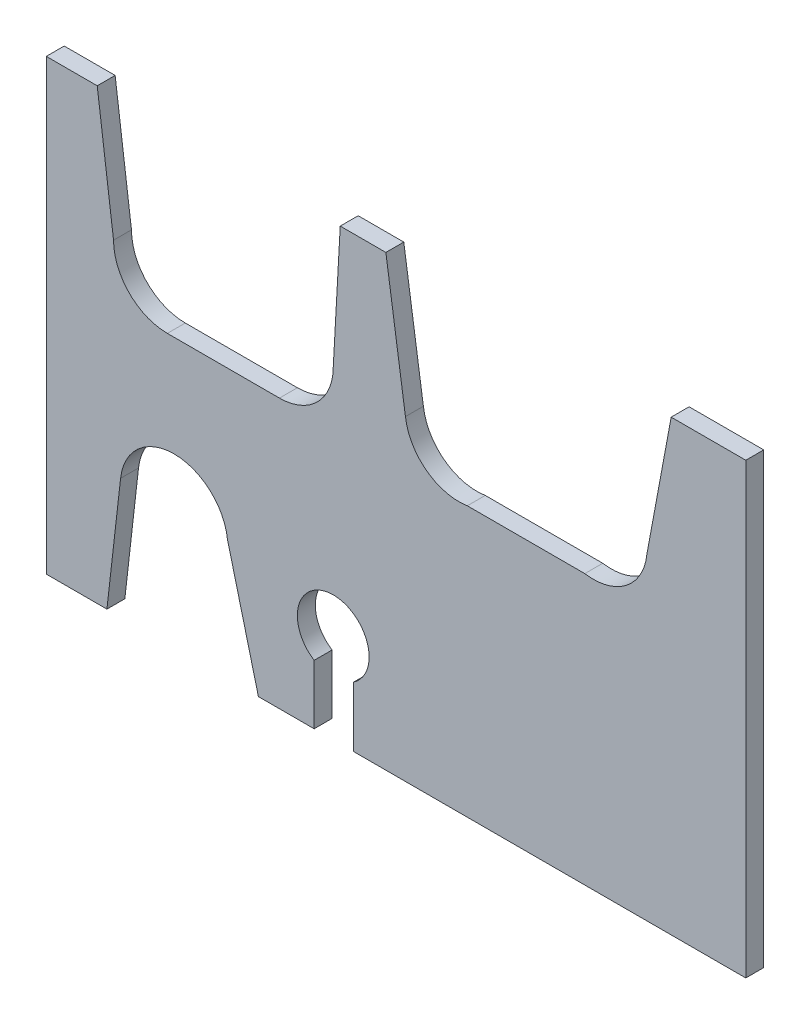
ISO-10303-21;
HEADER;
FILE_DESCRIPTION(('STEP AP214'),'2;1');
FILE_NAME('part.step','',(''),(''),'','','');
FILE_SCHEMA(('AUTOMOTIVE_DESIGN { 1 0 10303 214 1 1 1 1 }'));
ENDSEC;
DATA;
#1=APPLICATION_CONTEXT('core data for automotive mechanical design processes');
#2=APPLICATION_PROTOCOL_DEFINITION('international standard','automotive_design',2000,#1);
#3=PRODUCT_CONTEXT('',#1,'mechanical');
#4=PRODUCT('Part','Part','',(#3));
#5=PRODUCT_RELATED_PRODUCT_CATEGORY('part','',(#4));
#6=PRODUCT_DEFINITION_FORMATION('','',#4);
#7=PRODUCT_DEFINITION_CONTEXT('part definition',#1,'design');
#8=PRODUCT_DEFINITION('design','',#6,#7);
#9=PRODUCT_DEFINITION_SHAPE('','',#8);
#10=(LENGTH_UNIT() NAMED_UNIT(*) SI_UNIT(.MILLI.,.METRE.));
#11=(NAMED_UNIT(*) PLANE_ANGLE_UNIT() SI_UNIT($,.RADIAN.));
#12=(NAMED_UNIT(*) SI_UNIT($,.STERADIAN.) SOLID_ANGLE_UNIT());
#13=UNCERTAINTY_MEASURE_WITH_UNIT(LENGTH_MEASURE(1.E-05),#10,'distance_accuracy_value','');
#14=(GEOMETRIC_REPRESENTATION_CONTEXT(3) GLOBAL_UNCERTAINTY_ASSIGNED_CONTEXT((#13)) GLOBAL_UNIT_ASSIGNED_CONTEXT((#10,
#11,#12)) REPRESENTATION_CONTEXT('',''));
#15=CARTESIAN_POINT('',(0.,0.,0.));
#16=DIRECTION('',(0.,0.,1.));
#17=DIRECTION('',(1.,0.,0.));
#18=AXIS2_PLACEMENT_3D('',#15,#16,#17);
#19=CARTESIAN_POINT('',(-46.,32.,2.));
#20=DIRECTION('',(0.,-1.,0.));
#21=DIRECTION('',(0.,0.,-1.));
#22=AXIS2_PLACEMENT_3D('',#19,#20,#21);
#23=PLANE('',#22);
#24=DIRECTION('',(-1.,0.,0.));
#25=VECTOR('',#24,1.);
#26=CARTESIAN_POINT('',(-46.,32.,0.));
#27=LINE('',#26,#25);
#28=CARTESIAN_POINT('',(32.,32.,0.));
#29=VERTEX_POINT('',#28);
#30=CARTESIAN_POINT('',(23.6800072298775,32.,0.));
#31=VERTEX_POINT('',#30);
#32=EDGE_CURVE('E253',#29,#31,#27,.T.);
#33=ORIENTED_EDGE('',*,*,#32,.T.);
#34=DIRECTION('',(0.,0.,1.));
#35=VECTOR('',#34,1.);
#36=CARTESIAN_POINT('',(23.6800072298775,32.,0.));
#37=LINE('',#36,#35);
#38=CARTESIAN_POINT('',(23.6800072298775,32.,2.));
#39=VERTEX_POINT('',#38);
#40=EDGE_CURVE('E221',#31,#39,#37,.T.);
#41=ORIENTED_EDGE('',*,*,#40,.T.);
#42=DIRECTION('',(-1.,0.,0.));
#43=VECTOR('',#42,1.);
#44=CARTESIAN_POINT('',(-46.,32.,2.));
#45=LINE('',#44,#43);
#46=CARTESIAN_POINT('',(32.,32.,2.));
#47=VERTEX_POINT('',#46);
#48=EDGE_CURVE('E238',#47,#39,#45,.T.);
#49=ORIENTED_EDGE('',*,*,#48,.F.);
#50=DIRECTION('',(0.,0.,-1.));
#51=VECTOR('',#50,1.);
#52=CARTESIAN_POINT('',(32.,32.,2.));
#53=LINE('',#52,#51);
#54=EDGE_CURVE('E271',#47,#29,#53,.T.);
#55=ORIENTED_EDGE('',*,*,#54,.T.);
#56=EDGE_LOOP('',(#33,#41,#49,#55));
#57=FACE_BOUND('',#56,.T.);
#58=ADVANCED_FACE('F39',(#57),#23,.F.);
#59=CARTESIAN_POINT('',(-40.3195514634934,32.,2.));
#60=VERTEX_POINT('',#59);
#61=CARTESIAN_POINT('',(-46.,32.,2.));
#62=VERTEX_POINT('',#61);
#63=EDGE_CURVE('E236',#60,#62,#45,.T.);
#64=ORIENTED_EDGE('',*,*,#63,.F.);
#65=DIRECTION('',(0.,0.,1.));
#66=VECTOR('',#65,1.);
#67=CARTESIAN_POINT('',(-40.3195514634934,32.,0.));
#68=LINE('',#67,#66);
#69=CARTESIAN_POINT('',(-40.3195514634934,32.,0.));
#70=VERTEX_POINT('',#69);
#71=EDGE_CURVE('E380',#70,#60,#68,.T.);
#72=ORIENTED_EDGE('',*,*,#71,.F.);
#73=CARTESIAN_POINT('',(-46.,32.,0.));
#74=VERTEX_POINT('',#73);
#75=EDGE_CURVE('E252',#70,#74,#27,.T.);
#76=ORIENTED_EDGE('',*,*,#75,.T.);
#77=DIRECTION('',(0.,0.,-1.));
#78=VECTOR('',#77,1.);
#79=CARTESIAN_POINT('',(-46.,32.,2.));
#80=LINE('',#79,#78);
#81=EDGE_CURVE('E268',#62,#74,#80,.T.);
#82=ORIENTED_EDGE('',*,*,#81,.F.);
#83=EDGE_LOOP('',(#64,#72,#76,#82));
#84=FACE_BOUND('',#83,.T.);
#85=ADVANCED_FACE('F400',(#84),#23,.F.);
#86=CARTESIAN_POINT('',(-45.9999999999999,-18.,2.));
#87=DIRECTION('',(0.,1.,0.));
#88=DIRECTION('',(0.,0.,1.));
#89=AXIS2_PLACEMENT_3D('',#86,#87,#88);
#90=PLANE('',#89);
#91=DIRECTION('',(1.,0.,0.));
#92=VECTOR('',#91,1.);
#93=CARTESIAN_POINT('',(-45.9999999999999,-18.,2.));
#94=LINE('',#93,#92);
#95=CARTESIAN_POINT('',(-11.7335318842224,-18.,2.));
#96=VERTEX_POINT('',#95);
#97=CARTESIAN_POINT('',(32.,-18.,2.));
#98=VERTEX_POINT('',#97);
#99=EDGE_CURVE('E244',#96,#98,#94,.T.);
#100=ORIENTED_EDGE('',*,*,#99,.F.);
#101=DIRECTION('',(0.,0.,1.));
#102=VECTOR('',#101,1.);
#103=CARTESIAN_POINT('',(-11.7335318842224,-18.,0.));
#104=LINE('',#103,#102);
#105=CARTESIAN_POINT('',(-11.7335318842224,-18.,0.));
#106=VERTEX_POINT('',#105);
#107=EDGE_CURVE('E363',#106,#96,#104,.T.);
#108=ORIENTED_EDGE('',*,*,#107,.F.);
#109=DIRECTION('',(1.,0.,0.));
#110=VECTOR('',#109,1.);
#111=CARTESIAN_POINT('',(-45.9999999999999,-18.,0.));
#112=LINE('',#111,#110);
#113=CARTESIAN_POINT('',(32.,-18.,0.));
#114=VERTEX_POINT('',#113);
#115=EDGE_CURVE('E259',#106,#114,#112,.T.);
#116=ORIENTED_EDGE('',*,*,#115,.T.);
#117=DIRECTION('',(0.,0.,-1.));
#118=VECTOR('',#117,1.);
#119=CARTESIAN_POINT('',(32.,-18.,2.));
#120=LINE('',#119,#118);
#121=EDGE_CURVE('E248',#98,#114,#120,.T.);
#122=ORIENTED_EDGE('',*,*,#121,.F.);
#123=EDGE_LOOP('',(#100,#108,#116,#122));
#124=FACE_BOUND('',#123,.T.);
#125=ADVANCED_FACE('F430',(#124),#90,.F.);
#126=CARTESIAN_POINT('',(-22.3456340523427,-18.,0.));
#127=VERTEX_POINT('',#126);
#128=CARTESIAN_POINT('',(-16.1286236707562,-18.,0.));
#129=VERTEX_POINT('',#128);
#130=EDGE_CURVE('E262',#127,#129,#112,.T.);
#131=ORIENTED_EDGE('',*,*,#130,.T.);
#132=DIRECTION('',(0.,0.,1.));
#133=VECTOR('',#132,1.);
#134=CARTESIAN_POINT('',(-16.1286236707562,-18.,0.));
#135=LINE('',#134,#133);
#136=CARTESIAN_POINT('',(-16.1286236707562,-18.,2.));
#137=VERTEX_POINT('',#136);
#138=EDGE_CURVE('E365',#129,#137,#135,.T.);
#139=ORIENTED_EDGE('',*,*,#138,.T.);
#140=CARTESIAN_POINT('',(-22.3456340523427,-18.,2.));
#141=VERTEX_POINT('',#140);
#142=EDGE_CURVE('E249',#141,#137,#94,.T.);
#143=ORIENTED_EDGE('',*,*,#142,.F.);
#144=DIRECTION('',(0.,0.,1.));
#145=VECTOR('',#144,1.);
#146=CARTESIAN_POINT('',(-22.3456340523427,-18.,0.));
#147=LINE('',#146,#145);
#148=EDGE_CURVE('E321',#127,#141,#147,.T.);
#149=ORIENTED_EDGE('',*,*,#148,.F.);
#150=EDGE_LOOP('',(#131,#139,#143,#149));
#151=FACE_BOUND('',#150,.T.);
#152=ADVANCED_FACE('F440',(#151),#90,.F.);
#153=CARTESIAN_POINT('',(32.,32.,2.));
#154=DIRECTION('',(-1.,0.,0.));
#155=DIRECTION('',(0.,0.,1.));
#156=AXIS2_PLACEMENT_3D('',#153,#154,#155);
#157=PLANE('',#156);
#158=DIRECTION('',(0.,1.,0.));
#159=VECTOR('',#158,1.);
#160=CARTESIAN_POINT('',(32.,32.,0.));
#161=LINE('',#160,#159);
#162=EDGE_CURVE('E227',#114,#29,#161,.T.);
#163=ORIENTED_EDGE('',*,*,#162,.T.);
#164=ORIENTED_EDGE('',*,*,#54,.F.);
#165=DIRECTION('',(0.,1.,0.));
#166=VECTOR('',#165,1.);
#167=CARTESIAN_POINT('',(32.,32.,2.));
#168=LINE('',#167,#166);
#169=EDGE_CURVE('E233',#98,#47,#168,.T.);
#170=ORIENTED_EDGE('',*,*,#169,.F.);
#171=ORIENTED_EDGE('',*,*,#121,.T.);
#172=EDGE_LOOP('',(#163,#164,#170,#171));
#173=FACE_BOUND('',#172,.T.);
#174=ADVANCED_FACE('F41',(#173),#157,.F.);
#175=CARTESIAN_POINT('',(-8.13437362696619,32.,2.));
#176=VERTEX_POINT('',#175);
#177=CARTESIAN_POINT('',(-13.2215055956665,32.,2.));
#178=VERTEX_POINT('',#177);
#179=EDGE_CURVE('E242',#176,#178,#45,.T.);
#180=ORIENTED_EDGE('',*,*,#179,.F.);
#181=DIRECTION('',(0.,0.,1.));
#182=VECTOR('',#181,1.);
#183=CARTESIAN_POINT('',(-8.13437362696619,32.,0.));
#184=LINE('',#183,#182);
#185=CARTESIAN_POINT('',(-8.13437362696619,32.,0.));
#186=VERTEX_POINT('',#185);
#187=EDGE_CURVE('E343',#186,#176,#184,.T.);
#188=ORIENTED_EDGE('',*,*,#187,.F.);
#189=CARTESIAN_POINT('',(-13.2215055956665,32.,0.));
#190=VERTEX_POINT('',#189);
#191=EDGE_CURVE('E257',#186,#190,#27,.T.);
#192=ORIENTED_EDGE('',*,*,#191,.T.);
#193=DIRECTION('',(0.,0.,1.));
#194=VECTOR('',#193,1.);
#195=CARTESIAN_POINT('',(-13.2215055956665,32.,0.));
#196=LINE('',#195,#194);
#197=EDGE_CURVE('E382',#190,#178,#196,.T.);
#198=ORIENTED_EDGE('',*,*,#197,.T.);
#199=EDGE_LOOP('',(#180,#188,#192,#198));
#200=FACE_BOUND('',#199,.T.);
#201=ADVANCED_FACE('F405',(#200),#23,.F.);
#202=CARTESIAN_POINT('',(-46.,32.,2.));
#203=DIRECTION('',(1.,0.,0.));
#204=DIRECTION('',(0.,1.,0.));
#205=AXIS2_PLACEMENT_3D('',#202,#203,#204);
#206=PLANE('',#205);
#207=DIRECTION('',(0.,-1.,0.));
#208=VECTOR('',#207,1.);
#209=CARTESIAN_POINT('',(-46.,32.,0.));
#210=LINE('',#209,#208);
#211=CARTESIAN_POINT('',(-45.9999999999999,-18.,0.));
#212=VERTEX_POINT('',#211);
#213=EDGE_CURVE('E256',#74,#212,#210,.T.);
#214=ORIENTED_EDGE('',*,*,#213,.T.);
#215=DIRECTION('',(0.,0.,-1.));
#216=VECTOR('',#215,1.);
#217=CARTESIAN_POINT('',(-45.9999999999999,-18.,2.));
#218=LINE('',#217,#216);
#219=CARTESIAN_POINT('',(-45.9999999999999,-18.,2.));
#220=VERTEX_POINT('',#219);
#221=EDGE_CURVE('E265',#220,#212,#218,.T.);
#222=ORIENTED_EDGE('',*,*,#221,.F.);
#223=DIRECTION('',(0.,-1.,0.));
#224=VECTOR('',#223,1.);
#225=CARTESIAN_POINT('',(-46.,32.,2.));
#226=LINE('',#225,#224);
#227=EDGE_CURVE('E241',#62,#220,#226,.T.);
#228=ORIENTED_EDGE('',*,*,#227,.F.);
#229=ORIENTED_EDGE('',*,*,#81,.T.);
#230=EDGE_LOOP('',(#214,#222,#228,#229));
#231=FACE_BOUND('',#230,.T.);
#232=ADVANCED_FACE('F433',(#231),#206,.F.);
#233=CARTESIAN_POINT('',(-39.2382725395829,-18.,0.));
#234=VERTEX_POINT('',#233);
#235=EDGE_CURVE('E237',#212,#234,#112,.T.);
#236=ORIENTED_EDGE('',*,*,#235,.T.);
#237=DIRECTION('',(0.,0.,1.));
#238=VECTOR('',#237,1.);
#239=CARTESIAN_POINT('',(-39.2382725395829,-18.,0.));
#240=LINE('',#239,#238);
#241=CARTESIAN_POINT('',(-39.2382725395829,-18.,2.));
#242=VERTEX_POINT('',#241);
#243=EDGE_CURVE('E318',#234,#242,#240,.T.);
#244=ORIENTED_EDGE('',*,*,#243,.T.);
#245=EDGE_CURVE('E245',#220,#242,#94,.T.);
#246=ORIENTED_EDGE('',*,*,#245,.F.);
#247=ORIENTED_EDGE('',*,*,#221,.T.);
#248=EDGE_LOOP('',(#236,#244,#246,#247));
#249=FACE_BOUND('',#248,.T.);
#250=ADVANCED_FACE('F438',(#249),#90,.F.);
#251=CARTESIAN_POINT('',(0.,0.,2.));
#252=DIRECTION('',(0.,0.,1.));
#253=DIRECTION('',(1.,0.,0.));
#254=AXIS2_PLACEMENT_3D('',#251,#252,#253);
#255=PLANE('',#254);
#256=DIRECTION('',(0.,1.,0.));
#257=VECTOR('',#256,1.);
#258=CARTESIAN_POINT('',(-11.7335318842224,-18.,2.));
#259=LINE('',#258,#257);
#260=CARTESIAN_POINT('',(-11.7335318842224,-11.2959251023292,2.));
#261=VERTEX_POINT('',#260);
#262=EDGE_CURVE('E354',#96,#261,#259,.T.);
#263=ORIENTED_EDGE('',*,*,#262,.F.);
#264=ORIENTED_EDGE('',*,*,#99,.T.);
#265=ORIENTED_EDGE('',*,*,#169,.T.);
#266=ORIENTED_EDGE('',*,*,#48,.T.);
#267=DIRECTION('',(0.182555710752652,0.983195510807283,0.));
#268=VECTOR('',#267,1.);
#269=CARTESIAN_POINT('',(20.7849655271757,16.408091130313,2.));
#270=LINE('',#269,#268);
#271=CARTESIAN_POINT('',(20.9708361432332,17.4091398213961,2.));
#272=VERTEX_POINT('',#271);
#273=EDGE_CURVE('E336',#272,#39,#270,.T.);
#274=ORIENTED_EDGE('',*,*,#273,.F.);
#275=CARTESIAN_POINT('',(15.,18.,2.));
#276=DIRECTION('',(0.,0.,1.));
#277=DIRECTION('',(1.,0.,0.));
#278=AXIS2_PLACEMENT_3D('',#275,#276,#277);
#279=CIRCLE('',#278,6.);
#280=CARTESIAN_POINT('',(14.0509275961501,12.0755370224593,2.));
#281=VERTEX_POINT('',#280);
#282=EDGE_CURVE('E300',#281,#272,#279,.T.);
#283=ORIENTED_EDGE('',*,*,#282,.F.);
#284=DIRECTION('',(1.,0.,0.));
#285=VECTOR('',#284,1.);
#286=CARTESIAN_POINT('',(-0.9490724038499,12.0755370224593,2.));
#287=LINE('',#286,#285);
#288=CARTESIAN_POINT('',(0.949072403849912,12.0755370224593,2.));
#289=VERTEX_POINT('',#288);
#290=EDGE_CURVE('E296',#289,#281,#287,.T.);
#291=ORIENTED_EDGE('',*,*,#290,.F.);
#292=CARTESIAN_POINT('',(0.,18.,2.));
#293=DIRECTION('',(0.,0.,1.));
#294=DIRECTION('',(1.,0.,0.));
#295=AXIS2_PLACEMENT_3D('',#292,#293,#294);
#296=CIRCLE('',#295,6.);
#297=CARTESIAN_POINT('',(-5.95130549397016,17.2371350595023,2.));
#298=VERTEX_POINT('',#297);
#299=EDGE_CURVE('E285',#298,#289,#296,.T.);
#300=ORIENTED_EDGE('',*,*,#299,.F.);
#301=DIRECTION('',(0.14628487087861,-0.989242506442191,0.));
#302=VECTOR('',#301,1.);
#303=CARTESIAN_POINT('',(-8.13437362696619,32.,2.));
#304=LINE('',#303,#302);
#305=EDGE_CURVE('E293',#176,#298,#304,.T.);
#306=ORIENTED_EDGE('',*,*,#305,.F.);
#307=ORIENTED_EDGE('',*,*,#179,.T.);
#308=DIRECTION('',(0.0555209709482199,0.998457521272171,0.));
#309=VECTOR('',#308,1.);
#310=CARTESIAN_POINT('',(-14.,18.,2.));
#311=LINE('',#310,#309);
#312=CARTESIAN_POINT('',(-14.,18.,2.));
#313=VERTEX_POINT('',#312);
#314=EDGE_CURVE('E222',#313,#178,#311,.T.);
#315=ORIENTED_EDGE('',*,*,#314,.F.);
#316=CARTESIAN_POINT('',(-20.,18.,2.));
#317=DIRECTION('',(0.,0.,1.));
#318=DIRECTION('',(1.,0.,0.));
#319=AXIS2_PLACEMENT_3D('',#316,#317,#318);
#320=CIRCLE('',#319,6.);
#321=CARTESIAN_POINT('',(-20.,12.,2.));
#322=VERTEX_POINT('',#321);
#323=EDGE_CURVE('E220',#322,#313,#320,.T.);
#324=ORIENTED_EDGE('',*,*,#323,.F.);
#325=DIRECTION('',(1.,0.,0.));
#326=VECTOR('',#325,1.);
#327=CARTESIAN_POINT('',(-32.5,12.,2.));
#328=LINE('',#327,#326);
#329=CARTESIAN_POINT('',(-32.5,12.,2.));
#330=VERTEX_POINT('',#329);
#331=EDGE_CURVE('E202',#330,#322,#328,.T.);
#332=ORIENTED_EDGE('',*,*,#331,.F.);
#333=CARTESIAN_POINT('',(-32.5,18.,2.));
#334=DIRECTION('',(0.,0.,1.));
#335=DIRECTION('',(1.,0.,0.));
#336=AXIS2_PLACEMENT_3D('',#333,#334,#335);
#337=CIRCLE('',#336,6.);
#338=CARTESIAN_POINT('',(-38.5,18.,2.));
#339=VERTEX_POINT('',#338);
#340=EDGE_CURVE('E217',#339,#330,#337,.T.);
#341=ORIENTED_EDGE('',*,*,#340,.F.);
#342=DIRECTION('',(0.128883987087097,-0.991659678454525,0.));
#343=VECTOR('',#342,1.);
#344=CARTESIAN_POINT('',(-40.3195514634934,32.,2.));
#345=LINE('',#344,#343);
#346=EDGE_CURVE('E54',#60,#339,#345,.T.);
#347=ORIENTED_EDGE('',*,*,#346,.F.);
#348=ORIENTED_EDGE('',*,*,#63,.T.);
#349=ORIENTED_EDGE('',*,*,#227,.T.);
#350=ORIENTED_EDGE('',*,*,#245,.T.);
#351=DIRECTION('',(-0.113122078958532,-0.993581096464752,0.));
#352=VECTOR('',#351,1.);
#353=CARTESIAN_POINT('',(-37.7087383786613,-4.56569749530589,2.));
#354=LINE('',#353,#352);
#355=CARTESIAN_POINT('',(-37.7128121671291,-4.60147865535755,2.));
#356=VERTEX_POINT('',#355);
#357=EDGE_CURVE('E327',#356,#242,#354,.T.);
#358=ORIENTED_EDGE('',*,*,#357,.F.);
#359=CARTESIAN_POINT('',(-31.7493155392207,-5.2623174926885,2.));
#360=DIRECTION('',(0.,0.,1.));
#361=DIRECTION('',(1.,0.,0.));
#362=AXIS2_PLACEMENT_3D('',#359,#360,#361);
#363=CIRCLE('',#362,6.);
#364=CARTESIAN_POINT('',(-25.78989269978,-4.5656974953059,2.));
#365=VERTEX_POINT('',#364);
#366=EDGE_CURVE('E306',#365,#356,#363,.T.);
#367=ORIENTED_EDGE('',*,*,#366,.F.);
#368=DIRECTION('',(-0.24834596690096,0.968671399765693,0.));
#369=VECTOR('',#368,1.);
#370=CARTESIAN_POINT('',(-22.3456340523427,-18.,2.));
#371=LINE('',#370,#369);
#372=EDGE_CURVE('E62',#141,#365,#371,.T.);
#373=ORIENTED_EDGE('',*,*,#372,.F.);
#374=ORIENTED_EDGE('',*,*,#142,.T.);
#375=DIRECTION('',(0.,-1.,0.));
#376=VECTOR('',#375,1.);
#377=CARTESIAN_POINT('',(-16.1286236707562,-11.3865854881128,2.));
#378=LINE('',#377,#376);
#379=CARTESIAN_POINT('',(-16.1286236707562,-11.3865854881128,2.));
#380=VERTEX_POINT('',#379);
#381=EDGE_CURVE('E329',#380,#137,#378,.T.);
#382=ORIENTED_EDGE('',*,*,#381,.F.);
#383=CARTESIAN_POINT('',(-14.,-8.,2.));
#384=DIRECTION('',(0.,0.,1.));
#385=DIRECTION('',(1.,0.,0.));
#386=AXIS2_PLACEMENT_3D('',#383,#384,#385);
#387=CIRCLE('',#386,4.);
#388=EDGE_CURVE('E305',#261,#380,#387,.T.);
#389=ORIENTED_EDGE('',*,*,#388,.F.);
#390=EDGE_LOOP('',(#263,#264,#265,#266,#274,#283,#291,#300,#306,#307,#315,#324,#332,#341,#347,
#348,#349,#350,#358,#367,#373,#374,#382,#389));
#391=FACE_BOUND('',#390,.T.);
#392=ADVANCED_FACE('F216',(#391),#255,.T.);
#393=CARTESIAN_POINT('',(0.,0.,0.));
#394=DIRECTION('',(0.,0.,1.));
#395=DIRECTION('',(1.,0.,0.));
#396=AXIS2_PLACEMENT_3D('',#393,#394,#395);
#397=PLANE('',#396);
#398=ORIENTED_EDGE('',*,*,#115,.F.);
#399=DIRECTION('',(0.,1.,0.));
#400=VECTOR('',#399,1.);
#401=CARTESIAN_POINT('',(-11.7335318842224,-18.,0.));
#402=LINE('',#401,#400);
#403=CARTESIAN_POINT('',(-11.7335318842224,-11.2959251023292,0.));
#404=VERTEX_POINT('',#403);
#405=EDGE_CURVE('E355',#106,#404,#402,.T.);
#406=ORIENTED_EDGE('',*,*,#405,.T.);
#407=CARTESIAN_POINT('',(-14.,-8.,0.));
#408=DIRECTION('',(0.,0.,1.));
#409=DIRECTION('',(1.,0.,0.));
#410=AXIS2_PLACEMENT_3D('',#407,#408,#409);
#411=CIRCLE('',#410,4.);
#412=CARTESIAN_POINT('',(-16.1286236707562,-11.3865854881128,0.));
#413=VERTEX_POINT('',#412);
#414=EDGE_CURVE('E302',#404,#413,#411,.T.);
#415=ORIENTED_EDGE('',*,*,#414,.T.);
#416=DIRECTION('',(0.,-1.,0.));
#417=VECTOR('',#416,1.);
#418=CARTESIAN_POINT('',(-16.1286236707562,-11.3865854881128,0.));
#419=LINE('',#418,#417);
#420=EDGE_CURVE('E351',#413,#129,#419,.T.);
#421=ORIENTED_EDGE('',*,*,#420,.T.);
#422=ORIENTED_EDGE('',*,*,#130,.F.);
#423=DIRECTION('',(-0.24834596690096,0.968671399765693,0.));
#424=VECTOR('',#423,1.);
#425=CARTESIAN_POINT('',(-22.3456340523427,-18.,0.));
#426=LINE('',#425,#424);
#427=CARTESIAN_POINT('',(-25.78989269978,-4.56569749530589,0.));
#428=VERTEX_POINT('',#427);
#429=EDGE_CURVE('E322',#127,#428,#426,.T.);
#430=ORIENTED_EDGE('',*,*,#429,.T.);
#431=CARTESIAN_POINT('',(-31.7493155392207,-5.2623174926885,0.));
#432=DIRECTION('',(0.,0.,1.));
#433=DIRECTION('',(1.,0.,0.));
#434=AXIS2_PLACEMENT_3D('',#431,#432,#433);
#435=CIRCLE('',#434,6.);
#436=CARTESIAN_POINT('',(-37.7128121671291,-4.60147865535755,0.));
#437=VERTEX_POINT('',#436);
#438=EDGE_CURVE('E312',#428,#437,#435,.T.);
#439=ORIENTED_EDGE('',*,*,#438,.T.);
#440=DIRECTION('',(-0.113122078958532,-0.993581096464752,0.));
#441=VECTOR('',#440,1.);
#442=CARTESIAN_POINT('',(-37.7087383786613,-4.56569749530589,0.));
#443=LINE('',#442,#441);
#444=EDGE_CURVE('E326',#437,#234,#443,.T.);
#445=ORIENTED_EDGE('',*,*,#444,.T.);
#446=ORIENTED_EDGE('',*,*,#235,.F.);
#447=ORIENTED_EDGE('',*,*,#213,.F.);
#448=ORIENTED_EDGE('',*,*,#75,.F.);
#449=DIRECTION('',(0.128883987087097,-0.991659678454525,0.));
#450=VECTOR('',#449,1.);
#451=CARTESIAN_POINT('',(-40.3195514634934,32.,0.));
#452=LINE('',#451,#450);
#453=CARTESIAN_POINT('',(-38.5,18.,0.));
#454=VERTEX_POINT('',#453);
#455=EDGE_CURVE('E373',#70,#454,#452,.T.);
#456=ORIENTED_EDGE('',*,*,#455,.T.);
#457=CARTESIAN_POINT('',(-32.5,18.,0.));
#458=DIRECTION('',(0.,0.,1.));
#459=DIRECTION('',(1.,0.,0.));
#460=AXIS2_PLACEMENT_3D('',#457,#458,#459);
#461=CIRCLE('',#460,6.);
#462=CARTESIAN_POINT('',(-32.5,12.,0.));
#463=VERTEX_POINT('',#462);
#464=EDGE_CURVE('E225',#454,#463,#461,.T.);
#465=ORIENTED_EDGE('',*,*,#464,.T.);
#466=DIRECTION('',(1.,0.,0.));
#467=VECTOR('',#466,1.);
#468=CARTESIAN_POINT('',(-32.5,12.,0.));
#469=LINE('',#468,#467);
#470=CARTESIAN_POINT('',(-20.,12.,0.));
#471=VERTEX_POINT('',#470);
#472=EDGE_CURVE('E205',#463,#471,#469,.T.);
#473=ORIENTED_EDGE('',*,*,#472,.T.);
#474=CARTESIAN_POINT('',(-20.,18.,0.));
#475=DIRECTION('',(0.,0.,1.));
#476=DIRECTION('',(1.,0.,0.));
#477=AXIS2_PLACEMENT_3D('',#474,#475,#476);
#478=CIRCLE('',#477,6.);
#479=CARTESIAN_POINT('',(-14.,18.,0.));
#480=VERTEX_POINT('',#479);
#481=EDGE_CURVE('E229',#471,#480,#478,.T.);
#482=ORIENTED_EDGE('',*,*,#481,.T.);
#483=DIRECTION('',(0.0555209709482199,0.998457521272171,0.));
#484=VECTOR('',#483,1.);
#485=CARTESIAN_POINT('',(-14.,18.,0.));
#486=LINE('',#485,#484);
#487=EDGE_CURVE('E370',#480,#190,#486,.T.);
#488=ORIENTED_EDGE('',*,*,#487,.T.);
#489=ORIENTED_EDGE('',*,*,#191,.F.);
#490=DIRECTION('',(0.14628487087861,-0.989242506442191,0.));
#491=VECTOR('',#490,1.);
#492=CARTESIAN_POINT('',(-8.13437362696619,32.,0.));
#493=LINE('',#492,#491);
#494=CARTESIAN_POINT('',(-5.95130549397016,17.2371350595023,0.));
#495=VERTEX_POINT('',#494);
#496=EDGE_CURVE('E334',#186,#495,#493,.T.);
#497=ORIENTED_EDGE('',*,*,#496,.T.);
#498=CARTESIAN_POINT('',(0.,18.,0.));
#499=DIRECTION('',(0.,0.,1.));
#500=DIRECTION('',(1.,0.,0.));
#501=AXIS2_PLACEMENT_3D('',#498,#499,#500);
#502=CIRCLE('',#501,6.);
#503=CARTESIAN_POINT('',(0.949072403849912,12.0755370224593,0.));
#504=VERTEX_POINT('',#503);
#505=EDGE_CURVE('E287',#495,#504,#502,.T.);
#506=ORIENTED_EDGE('',*,*,#505,.T.);
#507=DIRECTION('',(1.,0.,0.));
#508=VECTOR('',#507,1.);
#509=CARTESIAN_POINT('',(-0.9490724038499,12.0755370224593,0.));
#510=LINE('',#509,#508);
#511=CARTESIAN_POINT('',(14.0509275961501,12.0755370224593,0.));
#512=VERTEX_POINT('',#511);
#513=EDGE_CURVE('E337',#504,#512,#510,.T.);
#514=ORIENTED_EDGE('',*,*,#513,.T.);
#515=CARTESIAN_POINT('',(15.,18.,0.));
#516=DIRECTION('',(0.,0.,1.));
#517=DIRECTION('',(1.,0.,0.));
#518=AXIS2_PLACEMENT_3D('',#515,#516,#517);
#519=CIRCLE('',#518,6.);
#520=CARTESIAN_POINT('',(20.9708361432332,17.4091398213961,0.));
#521=VERTEX_POINT('',#520);
#522=EDGE_CURVE('E309',#512,#521,#519,.T.);
#523=ORIENTED_EDGE('',*,*,#522,.T.);
#524=DIRECTION('',(0.182555710752652,0.983195510807283,0.));
#525=VECTOR('',#524,1.);
#526=CARTESIAN_POINT('',(20.7849655271757,16.408091130313,0.));
#527=LINE('',#526,#525);
#528=EDGE_CURVE('E340',#521,#31,#527,.T.);
#529=ORIENTED_EDGE('',*,*,#528,.T.);
#530=ORIENTED_EDGE('',*,*,#32,.F.);
#531=ORIENTED_EDGE('',*,*,#162,.F.);
#532=EDGE_LOOP('',(#398,#406,#415,#421,#422,#430,#439,#445,#446,#447,#448,#456,#465,#473,#482,
#488,#489,#497,#506,#514,#523,#529,#530,#531));
#533=FACE_BOUND('',#532,.T.);
#534=ADVANCED_FACE('F393',(#533),#397,.F.);
#535=CARTESIAN_POINT('',(-32.5,18.,0.));
#536=DIRECTION('',(0.,0.,1.));
#537=DIRECTION('',(1.,0.,0.));
#538=AXIS2_PLACEMENT_3D('',#535,#536,#537);
#539=CYLINDRICAL_SURFACE('',#538,6.);
#540=ORIENTED_EDGE('',*,*,#340,.T.);
#541=DIRECTION('',(0.,0.,1.));
#542=VECTOR('',#541,1.);
#543=CARTESIAN_POINT('',(-32.5,12.,0.));
#544=LINE('',#543,#542);
#545=EDGE_CURVE('E199',#463,#330,#544,.T.);
#546=ORIENTED_EDGE('',*,*,#545,.F.);
#547=ORIENTED_EDGE('',*,*,#464,.F.);
#548=DIRECTION('',(0.,0.,1.));
#549=VECTOR('',#548,1.);
#550=CARTESIAN_POINT('',(-38.5,18.,0.));
#551=LINE('',#550,#549);
#552=EDGE_CURVE('E210',#454,#339,#551,.T.);
#553=ORIENTED_EDGE('',*,*,#552,.T.);
#554=EDGE_LOOP('',(#540,#546,#547,#553));
#555=FACE_BOUND('',#554,.T.);
#556=ADVANCED_FACE('F224',(#555),#539,.F.);
#557=CARTESIAN_POINT('',(-31.7493155392207,-5.2623174926885,0.));
#558=DIRECTION('',(0.,0.,1.));
#559=DIRECTION('',(1.,0.,0.));
#560=AXIS2_PLACEMENT_3D('',#557,#558,#559);
#561=CYLINDRICAL_SURFACE('',#560,6.);
#562=ORIENTED_EDGE('',*,*,#366,.T.);
#563=DIRECTION('',(0.,0.,1.));
#564=VECTOR('',#563,1.);
#565=CARTESIAN_POINT('',(-37.7128121671289,-4.60147865535568,0.));
#566=LINE('',#565,#564);
#567=EDGE_CURVE('E11',#356,#437,#566,.F.);
#568=ORIENTED_EDGE('',*,*,#567,.T.);
#569=ORIENTED_EDGE('',*,*,#438,.F.);
#570=DIRECTION('',(0.,0.,1.));
#571=VECTOR('',#570,1.);
#572=CARTESIAN_POINT('',(-25.78989269978,-4.56569749530589,0.));
#573=LINE('',#572,#571);
#574=EDGE_CURVE('E317',#428,#365,#573,.T.);
#575=ORIENTED_EDGE('',*,*,#574,.T.);
#576=EDGE_LOOP('',(#562,#568,#569,#575));
#577=FACE_BOUND('',#576,.T.);
#578=ADVANCED_FACE('F474',(#577),#561,.F.);
#579=CARTESIAN_POINT('',(-20.,18.,0.));
#580=DIRECTION('',(0.,0.,1.));
#581=DIRECTION('',(1.,0.,0.));
#582=AXIS2_PLACEMENT_3D('',#579,#580,#581);
#583=CYLINDRICAL_SURFACE('',#582,6.);
#584=ORIENTED_EDGE('',*,*,#323,.T.);
#585=DIRECTION('',(0.,0.,1.));
#586=VECTOR('',#585,1.);
#587=CARTESIAN_POINT('',(-14.,18.,0.));
#588=LINE('',#587,#586);
#589=EDGE_CURVE('E385',#480,#313,#588,.T.);
#590=ORIENTED_EDGE('',*,*,#589,.F.);
#591=ORIENTED_EDGE('',*,*,#481,.F.);
#592=DIRECTION('',(0.,0.,1.));
#593=VECTOR('',#592,1.);
#594=CARTESIAN_POINT('',(-20.,12.,0.));
#595=LINE('',#594,#593);
#596=EDGE_CURVE('E375',#471,#322,#595,.T.);
#597=ORIENTED_EDGE('',*,*,#596,.T.);
#598=EDGE_LOOP('',(#584,#590,#591,#597));
#599=FACE_BOUND('',#598,.T.);
#600=ADVANCED_FACE('F389',(#599),#583,.F.);
#601=CARTESIAN_POINT('',(0.,18.,0.));
#602=DIRECTION('',(0.,0.,1.));
#603=DIRECTION('',(1.,0.,0.));
#604=AXIS2_PLACEMENT_3D('',#601,#602,#603);
#605=CYLINDRICAL_SURFACE('',#604,6.);
#606=ORIENTED_EDGE('',*,*,#299,.T.);
#607=DIRECTION('',(0.,0.,1.));
#608=VECTOR('',#607,1.);
#609=CARTESIAN_POINT('',(0.949072403849905,12.0755370224593,0.));
#610=LINE('',#609,#608);
#611=EDGE_CURVE('E314',#289,#504,#610,.F.);
#612=ORIENTED_EDGE('',*,*,#611,.T.);
#613=ORIENTED_EDGE('',*,*,#505,.F.);
#614=DIRECTION('',(0.,0.,1.));
#615=VECTOR('',#614,1.);
#616=CARTESIAN_POINT('',(-5.95130549397016,17.2371350595023,0.));
#617=LINE('',#616,#615);
#618=EDGE_CURVE('E47',#495,#298,#617,.T.);
#619=ORIENTED_EDGE('',*,*,#618,.T.);
#620=EDGE_LOOP('',(#606,#612,#613,#619));
#621=FACE_BOUND('',#620,.T.);
#622=ADVANCED_FACE('F283',(#621),#605,.F.);
#623=CARTESIAN_POINT('',(15.,18.,0.));
#624=DIRECTION('',(0.,0.,1.));
#625=DIRECTION('',(1.,0.,0.));
#626=AXIS2_PLACEMENT_3D('',#623,#624,#625);
#627=CYLINDRICAL_SURFACE('',#626,6.);
#628=ORIENTED_EDGE('',*,*,#282,.T.);
#629=DIRECTION('',(0.,0.,1.));
#630=VECTOR('',#629,1.);
#631=CARTESIAN_POINT('',(20.9708361432332,17.4091398213961,0.));
#632=LINE('',#631,#630);
#633=EDGE_CURVE('E277',#272,#521,#632,.F.);
#634=ORIENTED_EDGE('',*,*,#633,.T.);
#635=ORIENTED_EDGE('',*,*,#522,.F.);
#636=DIRECTION('',(0.,0.,1.));
#637=VECTOR('',#636,1.);
#638=CARTESIAN_POINT('',(14.0509275961501,12.0755370224593,0.));
#639=LINE('',#638,#637);
#640=EDGE_CURVE('E274',#512,#281,#639,.T.);
#641=ORIENTED_EDGE('',*,*,#640,.T.);
#642=EDGE_LOOP('',(#628,#634,#635,#641));
#643=FACE_BOUND('',#642,.T.);
#644=ADVANCED_FACE('F562',(#643),#627,.F.);
#645=CARTESIAN_POINT('',(-14.,-8.,0.));
#646=DIRECTION('',(0.,0.,1.));
#647=DIRECTION('',(1.,0.,0.));
#648=AXIS2_PLACEMENT_3D('',#645,#646,#647);
#649=CYLINDRICAL_SURFACE('',#648,4.);
#650=ORIENTED_EDGE('',*,*,#414,.F.);
#651=DIRECTION('',(0.,0.,1.));
#652=VECTOR('',#651,1.);
#653=CARTESIAN_POINT('',(-11.7335318842224,-11.2959251023292,0.));
#654=LINE('',#653,#652);
#655=EDGE_CURVE('E345',#404,#261,#654,.T.);
#656=ORIENTED_EDGE('',*,*,#655,.T.);
#657=ORIENTED_EDGE('',*,*,#388,.T.);
#658=DIRECTION('',(0.,0.,1.));
#659=VECTOR('',#658,1.);
#660=CARTESIAN_POINT('',(-16.1286236707562,-11.3865854881128,0.));
#661=LINE('',#660,#659);
#662=EDGE_CURVE('E358',#413,#380,#661,.T.);
#663=ORIENTED_EDGE('',*,*,#662,.F.);
#664=EDGE_LOOP('',(#650,#656,#657,#663));
#665=FACE_BOUND('',#664,.T.);
#666=ADVANCED_FACE('F469',(#665),#649,.F.);
#667=CARTESIAN_POINT('',(-16.1286236707562,-11.3865854881128,0.));
#668=DIRECTION('',(-1.,0.,0.));
#669=DIRECTION('',(0.,0.,1.));
#670=AXIS2_PLACEMENT_3D('',#667,#668,#669);
#671=PLANE('',#670);
#672=ORIENTED_EDGE('',*,*,#381,.T.);
#673=ORIENTED_EDGE('',*,*,#138,.F.);
#674=ORIENTED_EDGE('',*,*,#420,.F.);
#675=ORIENTED_EDGE('',*,*,#662,.T.);
#676=EDGE_LOOP('',(#672,#673,#674,#675));
#677=FACE_BOUND('',#676,.T.);
#678=ADVANCED_FACE('F466',(#677),#671,.F.);
#679=CARTESIAN_POINT('',(-11.7335318842224,-18.,0.));
#680=DIRECTION('',(1.,0.,0.));
#681=DIRECTION('',(0.,1.,0.));
#682=AXIS2_PLACEMENT_3D('',#679,#680,#681);
#683=PLANE('',#682);
#684=ORIENTED_EDGE('',*,*,#262,.T.);
#685=ORIENTED_EDGE('',*,*,#655,.F.);
#686=ORIENTED_EDGE('',*,*,#405,.F.);
#687=ORIENTED_EDGE('',*,*,#107,.T.);
#688=EDGE_LOOP('',(#684,#685,#686,#687));
#689=FACE_BOUND('',#688,.T.);
#690=ADVANCED_FACE('F590',(#689),#683,.F.);
#691=CARTESIAN_POINT('',(-0.9490724038499,12.0755370224593,0.));
#692=DIRECTION('',(0.,-1.,0.));
#693=DIRECTION('',(0.,0.,-1.));
#694=AXIS2_PLACEMENT_3D('',#691,#692,#693);
#695=PLANE('',#694);
#696=ORIENTED_EDGE('',*,*,#290,.T.);
#697=ORIENTED_EDGE('',*,*,#640,.F.);
#698=ORIENTED_EDGE('',*,*,#513,.F.);
#699=ORIENTED_EDGE('',*,*,#611,.F.);
#700=EDGE_LOOP('',(#696,#697,#698,#699));
#701=FACE_BOUND('',#700,.T.);
#702=ADVANCED_FACE('F420',(#701),#695,.F.);
#703=CARTESIAN_POINT('',(20.7849655271757,16.408091130313,0.));
#704=DIRECTION('',(0.983195510807283,-0.182555710752651,0.));
#705=DIRECTION('',(0.182555710752651,0.983195510807283,0.));
#706=AXIS2_PLACEMENT_3D('',#703,#704,#705);
#707=PLANE('',#706);
#708=ORIENTED_EDGE('',*,*,#273,.T.);
#709=ORIENTED_EDGE('',*,*,#40,.F.);
#710=ORIENTED_EDGE('',*,*,#528,.F.);
#711=ORIENTED_EDGE('',*,*,#633,.F.);
#712=EDGE_LOOP('',(#708,#709,#710,#711));
#713=FACE_BOUND('',#712,.T.);
#714=ADVANCED_FACE('F413',(#713),#707,.F.);
#715=CARTESIAN_POINT('',(-8.13437362696619,32.,0.));
#716=DIRECTION('',(-0.989242506442191,-0.14628487087861,0.));
#717=DIRECTION('',(0.14628487087861,-0.989242506442191,0.));
#718=AXIS2_PLACEMENT_3D('',#715,#716,#717);
#719=PLANE('',#718);
#720=ORIENTED_EDGE('',*,*,#496,.F.);
#721=ORIENTED_EDGE('',*,*,#187,.T.);
#722=ORIENTED_EDGE('',*,*,#305,.T.);
#723=ORIENTED_EDGE('',*,*,#618,.F.);
#724=EDGE_LOOP('',(#720,#721,#722,#723));
#725=FACE_BOUND('',#724,.T.);
#726=ADVANCED_FACE('F411',(#725),#719,.F.);
#727=CARTESIAN_POINT('',(-32.5,12.,0.));
#728=DIRECTION('',(0.,-1.,0.));
#729=DIRECTION('',(1.,0.,0.));
#730=AXIS2_PLACEMENT_3D('',#727,#728,#729);
#731=PLANE('',#730);
#732=ORIENTED_EDGE('',*,*,#331,.T.);
#733=ORIENTED_EDGE('',*,*,#596,.F.);
#734=ORIENTED_EDGE('',*,*,#472,.F.);
#735=ORIENTED_EDGE('',*,*,#545,.T.);
#736=EDGE_LOOP('',(#732,#733,#734,#735));
#737=FACE_BOUND('',#736,.T.);
#738=ADVANCED_FACE('F201',(#737),#731,.F.);
#739=CARTESIAN_POINT('',(-14.,18.,0.));
#740=DIRECTION('',(0.998457521272171,-0.0555209709482199,0.));
#741=DIRECTION('',(0.0555209709482199,0.998457521272171,0.));
#742=AXIS2_PLACEMENT_3D('',#739,#740,#741);
#743=PLANE('',#742);
#744=ORIENTED_EDGE('',*,*,#314,.T.);
#745=ORIENTED_EDGE('',*,*,#197,.F.);
#746=ORIENTED_EDGE('',*,*,#487,.F.);
#747=ORIENTED_EDGE('',*,*,#589,.T.);
#748=EDGE_LOOP('',(#744,#745,#746,#747));
#749=FACE_BOUND('',#748,.T.);
#750=ADVANCED_FACE('F409',(#749),#743,.F.);
#751=CARTESIAN_POINT('',(-37.7087383786613,-4.56569749530589,0.));
#752=DIRECTION('',(-0.993581096464753,0.113122078958532,0.));
#753=DIRECTION('',(-0.113122078958532,-0.993581096464752,0.));
#754=AXIS2_PLACEMENT_3D('',#751,#752,#753);
#755=PLANE('',#754);
#756=ORIENTED_EDGE('',*,*,#357,.T.);
#757=ORIENTED_EDGE('',*,*,#243,.F.);
#758=ORIENTED_EDGE('',*,*,#444,.F.);
#759=ORIENTED_EDGE('',*,*,#567,.F.);
#760=EDGE_LOOP('',(#756,#757,#758,#759));
#761=FACE_BOUND('',#760,.T.);
#762=ADVANCED_FACE('F477',(#761),#755,.F.);
#763=CARTESIAN_POINT('',(-22.3456340523427,-18.,0.));
#764=DIRECTION('',(0.968671399765693,0.24834596690096,0.));
#765=DIRECTION('',(-0.24834596690096,0.968671399765693,0.));
#766=AXIS2_PLACEMENT_3D('',#763,#764,#765);
#767=PLANE('',#766);
#768=ORIENTED_EDGE('',*,*,#372,.T.);
#769=ORIENTED_EDGE('',*,*,#574,.F.);
#770=ORIENTED_EDGE('',*,*,#429,.F.);
#771=ORIENTED_EDGE('',*,*,#148,.T.);
#772=EDGE_LOOP('',(#768,#769,#770,#771));
#773=FACE_BOUND('',#772,.T.);
#774=ADVANCED_FACE('F647',(#773),#767,.F.);
#775=CARTESIAN_POINT('',(-40.3195514634934,32.,0.));
#776=DIRECTION('',(-0.991659678454526,-0.128883987087097,0.));
#777=DIRECTION('',(0.128883987087097,-0.991659678454526,0.));
#778=AXIS2_PLACEMENT_3D('',#775,#776,#777);
#779=PLANE('',#778);
#780=ORIENTED_EDGE('',*,*,#346,.T.);
#781=ORIENTED_EDGE('',*,*,#552,.F.);
#782=ORIENTED_EDGE('',*,*,#455,.F.);
#783=ORIENTED_EDGE('',*,*,#71,.T.);
#784=EDGE_LOOP('',(#780,#781,#782,#783));
#785=FACE_BOUND('',#784,.T.);
#786=ADVANCED_FACE('F397',(#785),#779,.F.);
#787=CLOSED_SHELL('',(#58,#85,#125,#152,#174,#201,#232,#250,#392,#534,#556,#578,#600,#622,#644,
#666,#678,#690,#702,#714,#726,#738,#750,#762,#774,#786));
#788=MANIFOLD_SOLID_BREP('B2',#787);
#789=ADVANCED_BREP_SHAPE_REPRESENTATION('',(#18,#788),#14);
#790=SHAPE_DEFINITION_REPRESENTATION(#9,#789);
ENDSEC;
END-ISO-10303-21;
